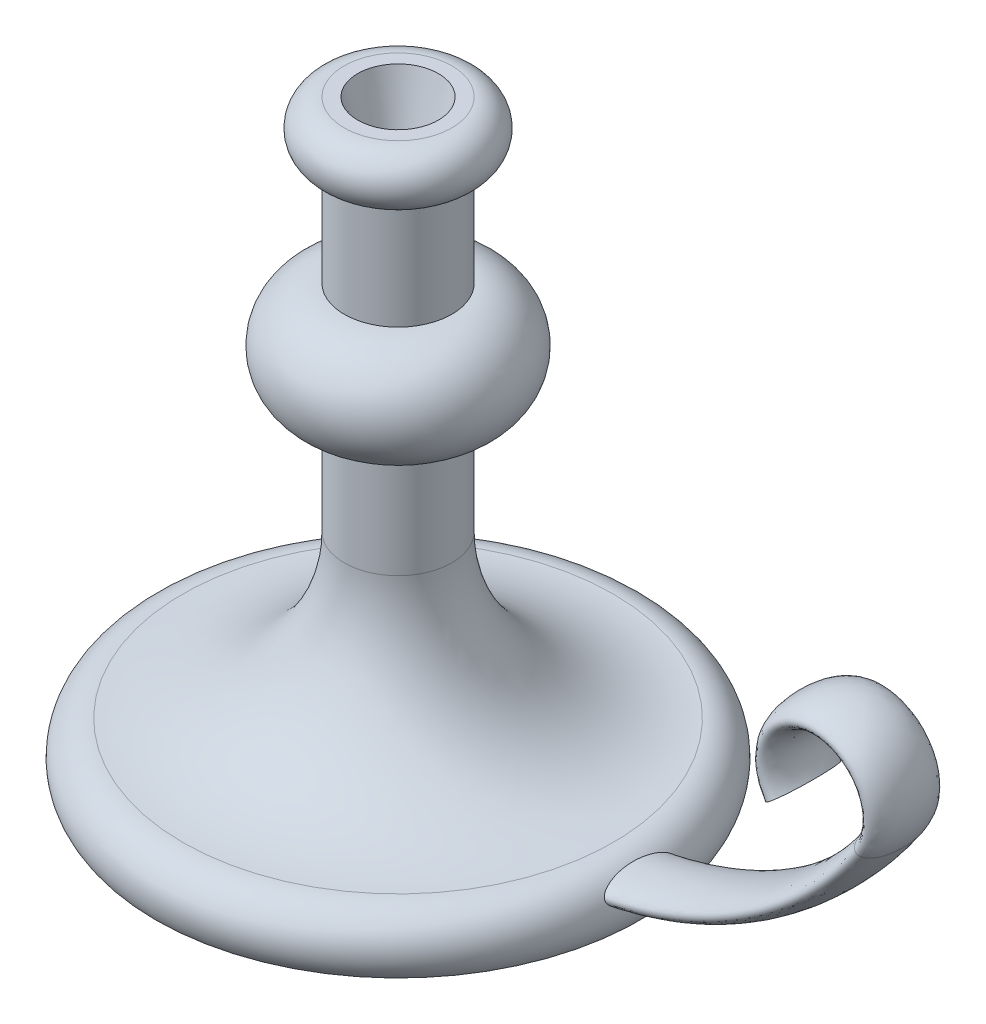
ISO-10303-21;
HEADER;
FILE_DESCRIPTION(('STEP AP214'),'2;1');
FILE_NAME('part.step','',(''),(''),'','','');
FILE_SCHEMA(('AUTOMOTIVE_DESIGN { 1 0 10303 214 1 1 1 1 }'));
ENDSEC;
DATA;
#1=APPLICATION_CONTEXT('core data for automotive mechanical design processes');
#2=APPLICATION_PROTOCOL_DEFINITION('international standard','automotive_design',2000,#1);
#3=PRODUCT_CONTEXT('',#1,'mechanical');
#4=PRODUCT('Part','Part','',(#3));
#5=PRODUCT_RELATED_PRODUCT_CATEGORY('part','',(#4));
#6=PRODUCT_DEFINITION_FORMATION('','',#4);
#7=PRODUCT_DEFINITION_CONTEXT('part definition',#1,'design');
#8=PRODUCT_DEFINITION('design','',#6,#7);
#9=PRODUCT_DEFINITION_SHAPE('','',#8);
#10=(LENGTH_UNIT() NAMED_UNIT(*) SI_UNIT(.MILLI.,.METRE.));
#11=(NAMED_UNIT(*) PLANE_ANGLE_UNIT() SI_UNIT($,.RADIAN.));
#12=(NAMED_UNIT(*) SI_UNIT($,.STERADIAN.) SOLID_ANGLE_UNIT());
#13=UNCERTAINTY_MEASURE_WITH_UNIT(LENGTH_MEASURE(1.E-05),#10,'distance_accuracy_value','');
#14=(GEOMETRIC_REPRESENTATION_CONTEXT(3) GLOBAL_UNCERTAINTY_ASSIGNED_CONTEXT((#13)) GLOBAL_UNIT_ASSIGNED_CONTEXT((#10,
#11,#12)) REPRESENTATION_CONTEXT('',''));
#15=CARTESIAN_POINT('',(0.,0.,0.));
#16=DIRECTION('',(0.,0.,1.));
#17=DIRECTION('',(1.,0.,0.));
#18=AXIS2_PLACEMENT_3D('',#15,#16,#17);
#19=CARTESIAN_POINT('',(0.,0.,0.));
#20=DIRECTION('',(0.,-1.,0.));
#21=DIRECTION('',(0.,0.,-1.));
#22=AXIS2_PLACEMENT_3D('',#19,#20,#21);
#23=PLANE('',#22);
#24=CARTESIAN_POINT('',(0.,0.,0.));
#25=DIRECTION('',(0.,-1.,0.));
#26=DIRECTION('',(0.,0.,-1.));
#27=AXIS2_PLACEMENT_3D('',#24,#25,#26);
#28=CIRCLE('',#27,90.);
#29=CARTESIAN_POINT('',(0.,0.,-90.));
#30=VERTEX_POINT('',#29);
#31=EDGE_CURVE('E74',#30,#30,#28,.T.);
#32=ORIENTED_EDGE('',*,*,#31,.T.);
#33=EDGE_LOOP('',(#32));
#34=FACE_BOUND('',#33,.T.);
#35=ADVANCED_FACE('F41',(#34),#23,.T.);
#36=CARTESIAN_POINT('',(0.,220.,0.));
#37=DIRECTION('',(0.,1.,0.));
#38=DIRECTION('',(0.,0.,1.));
#39=AXIS2_PLACEMENT_3D('',#36,#37,#38);
#40=PLANE('',#39);
#41=CARTESIAN_POINT('',(0.,220.,0.));
#42=DIRECTION('',(0.,1.,0.));
#43=DIRECTION('',(0.,0.,1.));
#44=AXIS2_PLACEMENT_3D('',#41,#42,#43);
#45=CIRCLE('',#44,15.);
#46=CARTESIAN_POINT('',(0.,220.,15.));
#47=VERTEX_POINT('',#46);
#48=EDGE_CURVE('E86',#47,#47,#45,.T.);
#49=ORIENTED_EDGE('',*,*,#48,.F.);
#50=EDGE_LOOP('',(#49));
#51=FACE_BOUND('',#50,.T.);
#52=CARTESIAN_POINT('',(0.,220.,0.));
#53=DIRECTION('',(0.,-1.,0.));
#54=DIRECTION('',(0.,0.,-1.));
#55=AXIS2_PLACEMENT_3D('',#52,#53,#54);
#56=CIRCLE('',#55,20.);
#57=CARTESIAN_POINT('',(0.,220.,-20.));
#58=VERTEX_POINT('',#57);
#59=EDGE_CURVE('E52',#58,#58,#56,.T.);
#60=ORIENTED_EDGE('',*,*,#59,.F.);
#61=EDGE_LOOP('',(#60));
#62=FACE_BOUND('',#61,.T.);
#63=ADVANCED_FACE('F92',(#51,#62),#40,.T.);
#64=CARTESIAN_POINT('',(0.,210.,0.));
#65=DIRECTION('',(0.,-1.,0.));
#66=DIRECTION('',(0.,0.,-1.));
#67=AXIS2_PLACEMENT_3D('',#64,#65,#66);
#68=TOROIDAL_SURFACE('',#67,20.,10.);
#69=ORIENTED_EDGE('',*,*,#59,.T.);
#70=EDGE_LOOP('',(#69));
#71=FACE_BOUND('',#70,.T.);
#72=CARTESIAN_POINT('',(0.,200.,0.));
#73=DIRECTION('',(0.,-1.,0.));
#74=DIRECTION('',(0.,0.,-1.));
#75=AXIS2_PLACEMENT_3D('',#72,#73,#74);
#76=CIRCLE('',#75,20.);
#77=CARTESIAN_POINT('',(0.,200.,-20.));
#78=VERTEX_POINT('',#77);
#79=EDGE_CURVE('E56',#78,#78,#76,.T.);
#80=ORIENTED_EDGE('',*,*,#79,.F.);
#81=EDGE_LOOP('',(#80));
#82=FACE_BOUND('',#81,.T.);
#83=ADVANCED_FACE('F95',(#71,#82),#68,.T.);
#84=CARTESIAN_POINT('',(0.,0.,0.));
#85=DIRECTION('',(0.,-1.,0.));
#86=DIRECTION('',(0.,0.,-1.));
#87=AXIS2_PLACEMENT_3D('',#84,#85,#86);
#88=CYLINDRICAL_SURFACE('',#87,20.);
#89=ORIENTED_EDGE('',*,*,#79,.T.);
#90=EDGE_LOOP('',(#89));
#91=FACE_BOUND('',#90,.T.);
#92=CARTESIAN_POINT('',(0.,160.,0.));
#93=DIRECTION('',(0.,-1.,0.));
#94=DIRECTION('',(0.,0.,-1.));
#95=AXIS2_PLACEMENT_3D('',#92,#93,#94);
#96=CIRCLE('',#95,20.);
#97=CARTESIAN_POINT('',(0.,160.,-20.));
#98=VERTEX_POINT('',#97);
#99=EDGE_CURVE('E60',#98,#98,#96,.T.);
#100=ORIENTED_EDGE('',*,*,#99,.F.);
#101=EDGE_LOOP('',(#100));
#102=FACE_BOUND('',#101,.T.);
#103=ADVANCED_FACE('F101',(#91,#102),#88,.T.);
#104=CARTESIAN_POINT('',(0.,140.,0.));
#105=DIRECTION('',(0.,-1.,0.));
#106=DIRECTION('',(0.,0.,-1.));
#107=AXIS2_PLACEMENT_3D('',#104,#105,#106);
#108=TOROIDAL_SURFACE('',#107,20.,20.);
#109=ORIENTED_EDGE('',*,*,#99,.T.);
#110=EDGE_LOOP('',(#109));
#111=FACE_BOUND('',#110,.T.);
#112=CARTESIAN_POINT('',(0.,120.,0.));
#113=DIRECTION('',(0.,-1.,0.));
#114=DIRECTION('',(0.,0.,-1.));
#115=AXIS2_PLACEMENT_3D('',#112,#113,#114);
#116=CIRCLE('',#115,20.);
#117=CARTESIAN_POINT('',(0.,120.,-20.));
#118=VERTEX_POINT('',#117);
#119=EDGE_CURVE('E65',#118,#118,#116,.T.);
#120=ORIENTED_EDGE('',*,*,#119,.F.);
#121=EDGE_LOOP('',(#120));
#122=FACE_BOUND('',#121,.T.);
#123=ADVANCED_FACE('F108',(#111,#122),#108,.T.);
#124=CARTESIAN_POINT('',(0.,0.,0.));
#125=DIRECTION('',(0.,-1.,0.));
#126=DIRECTION('',(0.,0.,-1.));
#127=AXIS2_PLACEMENT_3D('',#124,#125,#126);
#128=CYLINDRICAL_SURFACE('',#127,20.);
#129=ORIENTED_EDGE('',*,*,#119,.T.);
#130=EDGE_LOOP('',(#129));
#131=FACE_BOUND('',#130,.T.);
#132=CARTESIAN_POINT('',(0.,79.9999999999999,0.));
#133=DIRECTION('',(0.,-1.,0.));
#134=DIRECTION('',(0.,0.,-1.));
#135=AXIS2_PLACEMENT_3D('',#132,#133,#134);
#136=CIRCLE('',#135,20.);
#137=CARTESIAN_POINT('',(0.,79.9999999999999,-20.));
#138=VERTEX_POINT('',#137);
#139=EDGE_CURVE('E68',#138,#138,#136,.T.);
#140=ORIENTED_EDGE('',*,*,#139,.F.);
#141=EDGE_LOOP('',(#140));
#142=FACE_BOUND('',#141,.T.);
#143=ADVANCED_FACE('F112',(#131,#142),#128,.T.);
#144=CARTESIAN_POINT('',(0.,80.,0.));
#145=DIRECTION('',(0.,-1.,0.));
#146=DIRECTION('',(0.,0.,-1.));
#147=AXIS2_PLACEMENT_3D('',#144,#145,#146);
#148=TOROIDAL_SURFACE('',#147,80.,60.);
#149=ORIENTED_EDGE('',*,*,#139,.T.);
#150=EDGE_LOOP('',(#149));
#151=FACE_BOUND('',#150,.T.);
#152=CARTESIAN_POINT('',(0.,20.,0.));
#153=DIRECTION('',(0.,-1.,0.));
#154=DIRECTION('',(0.,0.,-1.));
#155=AXIS2_PLACEMENT_3D('',#152,#153,#154);
#156=CIRCLE('',#155,79.9999999999999);
#157=CARTESIAN_POINT('',(0.,20.,-79.9999999999999));
#158=VERTEX_POINT('',#157);
#159=EDGE_CURVE('E71',#158,#158,#156,.T.);
#160=ORIENTED_EDGE('',*,*,#159,.F.);
#161=EDGE_LOOP('',(#160));
#162=FACE_BOUND('',#161,.T.);
#163=ADVANCED_FACE('F116',(#151,#162),#148,.F.);
#164=CARTESIAN_POINT('',(0.,7.49999999999996,0.));
#165=DIRECTION('',(0.,-1.,0.));
#166=DIRECTION('',(0.,0.,-1.));
#167=AXIS2_PLACEMENT_3D('',#164,#165,#166);
#168=TOROIDAL_SURFACE('',#167,80.,12.5);
#169=CARTESIAN_POINT('',(90.2086800058325,13.0733664296864,-13.3333333333333));
#170=CARTESIAN_POINT('',(90.180788341327,13.1287581038346,-13.3333335065266));
#171=CARTESIAN_POINT('',(90.152819751234,13.1841126871976,-13.3304579714573));
#172=CARTESIAN_POINT('',(90.096953081087,13.2942710618353,-13.3190582345396));
#173=CARTESIAN_POINT('',(90.0690550051756,13.3490748212875,-13.3105337082183));
#174=CARTESIAN_POINT('',(90.0135163223238,13.4577415940159,-13.2880887667924));
#175=CARTESIAN_POINT('',(89.9858759076496,13.5116039275173,-13.2741646083921));
#176=CARTESIAN_POINT('',(89.9310311482349,13.6180274414278,-13.241296367624));
#177=CARTESIAN_POINT('',(89.9038270434493,13.6705879139625,-13.2223496170623));
#178=CARTESIAN_POINT('',(89.8428213050026,13.7879333165246,-13.1742292294118));
#179=CARTESIAN_POINT('',(89.8091933699416,13.852243414543,-13.1436757704697));
#180=CARTESIAN_POINT('',(89.7430189103146,13.9780544382001,-13.076200643521));
#181=CARTESIAN_POINT('',(89.7104732397881,14.039553159014,-13.039274082213));
#182=CARTESIAN_POINT('',(89.6465154003189,14.1596758428068,-12.9599437213261));
#183=CARTESIAN_POINT('',(89.6151050735415,14.218295184661,-12.9175314901343));
#184=CARTESIAN_POINT('',(89.5534977703328,14.3325530571061,-12.8281300002245));
#185=CARTESIAN_POINT('',(89.5233005256941,14.3881922475132,-12.7811417611979));
#186=CARTESIAN_POINT('',(89.4439005056219,14.5335594653448,-12.6499588157859));
#187=CARTESIAN_POINT('',(89.3957661862561,14.6206856668047,-12.5622261968992));
#188=CARTESIAN_POINT('',(89.3025596119839,14.7875884687574,-12.3785249052795));
#189=CARTESIAN_POINT('',(89.2574896484861,14.8673595849294,-12.2825501881792));
#190=CARTESIAN_POINT('',(89.1700362837097,15.020470456462,-12.0841212574802));
#191=CARTESIAN_POINT('',(89.1276587788778,15.0937962226433,-11.9816537421325));
#192=CARTESIAN_POINT('',(89.0454135891316,15.2345544871548,-11.7718544500061));
#193=CARTESIAN_POINT('',(89.0055453677156,15.3019882464409,-11.6645237215133));
#194=CARTESIAN_POINT('',(88.9253874422836,15.4360941875148,-11.4384873950312));
#195=CARTESIAN_POINT('',(88.8852568656295,15.5023959459515,-11.3195068563186));
#196=CARTESIAN_POINT('',(88.8072827154018,15.6297370336076,-11.0780136964315));
#197=CARTESIAN_POINT('',(88.7694396791958,15.6907751277616,-10.9555002552472));
#198=CARTESIAN_POINT('',(88.6958036195511,15.8081904873548,-10.707535571938));
#199=CARTESIAN_POINT('',(88.6600122903065,15.8645639175138,-10.5820820190897));
#200=CARTESIAN_POINT('',(88.5903362154428,15.9730719595632,-10.3288274798586));
#201=CARTESIAN_POINT('',(88.5564516996087,16.0252060609192,-10.2010262130104));
#202=CARTESIAN_POINT('',(88.4573163032156,16.1760504112737,-9.81422350770335));
#203=CARTESIAN_POINT('',(88.3947172452799,16.2689908808603,-9.55228013387044));
#204=CARTESIAN_POINT('',(88.2758015970914,16.4419450221625,-9.02295772190436));
#205=CARTESIAN_POINT('',(88.2194825782747,16.5219636962892,-8.75558083259615));
#206=CARTESIAN_POINT('',(88.12525302961,16.6532647526946,-8.28050995752687));
#207=CARTESIAN_POINT('',(88.08614275208,16.7068634208172,-8.07368683649478));
#208=CARTESIAN_POINT('',(88.0111201099692,16.8082161892091,-7.65803366104923));
#209=CARTESIAN_POINT('',(87.9752079433209,16.8559699278013,-7.44920348330301));
#210=CARTESIAN_POINT('',(87.8720580390742,16.9913110848532,-6.81988789896631));
#211=CARTESIAN_POINT('',(87.8094696938684,17.0708921216136,-6.39689693205009));
#212=CARTESIAN_POINT('',(87.6963296904708,17.2116946332599,-5.54616474321149));
#213=CARTESIAN_POINT('',(87.645783147211,17.2729083091947,-5.11842158317931));
#214=CARTESIAN_POINT('',(87.5566607082591,17.3790242853826,-4.25872185122846));
#215=CARTESIAN_POINT('',(87.5181114641493,17.4238903070895,-3.82675806642227));
#216=CARTESIAN_POINT('',(87.4533024808533,17.4984291226988,-2.96085052023624));
#217=CARTESIAN_POINT('',(87.4270362081082,17.528109994679,-2.52690793574537));
#218=CARTESIAN_POINT('',(87.3869398918786,17.5731300549506,-1.6577899237346));
#219=CARTESIAN_POINT('',(87.3731077118968,17.5884717071072,-1.22261472090603));
#220=CARTESIAN_POINT('',(87.357160148827,17.6061532462903,-0.30407167630149));
#221=CARTESIAN_POINT('',(87.356494192294,17.6068848395905,0.179353527193571));
#222=CARTESIAN_POINT('',(87.3706173067994,17.5912375300013,1.14583125496165));
#223=CARTESIAN_POINT('',(87.385410624598,17.5748539254595,1.62888364033024));
#224=CARTESIAN_POINT('',(87.4303180900927,17.5244179994886,2.59363157238418));
#225=CARTESIAN_POINT('',(87.4604406562886,17.4903559692369,3.07532622711445));
#226=CARTESIAN_POINT('',(87.5356427079468,17.403537268173,4.03421366266309));
#227=CARTESIAN_POINT('',(87.5806713768974,17.350844072014,4.51141614999079));
#228=CARTESIAN_POINT('',(87.6855054513775,17.2248458401586,5.4613133814671));
#229=CARTESIAN_POINT('',(87.7453040995963,17.1515502280197,5.93401008460004));
#230=CARTESIAN_POINT('',(87.8461384082646,17.0238995659159,6.63799284389236));
#231=CARTESIAN_POINT('',(87.8815894543343,16.9784199212847,6.87171733151569));
#232=CARTESIAN_POINT('',(87.956281259254,16.8810132452122,7.33720186133338));
#233=CARTESIAN_POINT('',(87.9955216567015,16.8290868284853,7.56896208857665));
#234=CARTESIAN_POINT('',(88.0692118195033,16.7298503236631,7.98137675928796));
#235=CARTESIAN_POINT('',(88.1029229272549,16.6838816203177,8.16248656481654));
#236=CARTESIAN_POINT('',(88.1728716497731,16.5871248757496,8.522923767582));
#237=CARTESIAN_POINT('',(88.2091091952013,16.5363369667768,8.70225121358171));
#238=CARTESIAN_POINT('',(88.2841577111113,16.4295765444934,9.0583718728281));
#239=CARTESIAN_POINT('',(88.3229628456748,16.3736156811338,9.23516979279913));
#240=CARTESIAN_POINT('',(88.4033904884436,16.25583204531,9.58614412963552));
#241=CARTESIAN_POINT('',(88.4450127219058,16.1940098442494,9.76032080012403));
#242=CARTESIAN_POINT('',(88.5312279284015,16.0639047155162,10.1050800899276));
#243=CARTESIAN_POINT('',(88.575814591266,15.9956353888185,10.2756693864966));
#244=CARTESIAN_POINT('',(88.668535131451,15.8513394172281,10.6134134863941));
#245=CARTESIAN_POINT('',(88.7166821725154,15.775283539623,10.780552288961));
#246=CARTESIAN_POINT('',(88.8176946744776,15.6130373496076,11.1124007497427));
#247=CARTESIAN_POINT('',(88.8706291600755,15.5266900202246,11.2770133964228));
#248=CARTESIAN_POINT('',(88.9811156384867,15.3433273907581,11.598885967195));
#249=CARTESIAN_POINT('',(89.0386718736252,15.2463022584975,11.7561389213438));
#250=CARTESIAN_POINT('',(89.1587599837859,15.0403117337069,12.0591769698947));
#251=CARTESIAN_POINT('',(89.2212597281084,14.931421949323,12.205025556361));
#252=CARTESIAN_POINT('',(89.3523701436711,14.6990161264433,12.4814034500695));
#253=CARTESIAN_POINT('',(89.4209660124921,14.5755352892695,12.6119681727889));
#254=CARTESIAN_POINT('',(89.5184729600696,14.3970352125889,12.7731999307196));
#255=CARTESIAN_POINT('',(89.5443726121328,14.3493605935515,12.8138836897012));
#256=CARTESIAN_POINT('',(89.5970521398833,14.2518450575757,12.891927463411));
#257=CARTESIAN_POINT('',(89.6238319727269,14.2020042460411,12.9292876395907));
#258=CARTESIAN_POINT('',(89.7055265237754,14.0491165217339,13.0356397148151));
#259=CARTESIAN_POINT('',(89.7618247931055,13.9426522260166,13.098951468648));
#260=CARTESIAN_POINT('',(89.8489072745659,13.7762379977576,13.1791112148032));
#261=CARTESIAN_POINT('',(89.8785757723234,13.7192537801046,13.2034721750676));
#262=CARTESIAN_POINT('',(89.9385554363041,13.6034798068172,13.246385144557));
#263=CARTESIAN_POINT('',(89.968866211596,13.5446911402362,13.264940584773));
#264=CARTESIAN_POINT('',(90.0299035404707,13.4257562006313,13.2956552790204));
#265=CARTESIAN_POINT('',(90.0606295820748,13.3656115473723,13.307821782236));
#266=CARTESIAN_POINT('',(90.1222717119844,13.2444319745412,13.325356425505));
#267=CARTESIAN_POINT('',(90.1531877745841,13.1833971739168,13.3307254656149));
#268=CARTESIAN_POINT('',(90.2118325877534,13.0671683646198,13.3342670387288));
#269=CARTESIAN_POINT('',(90.2395716903376,13.011998963916,13.3331039303349));
#270=CARTESIAN_POINT('',(90.2947427117053,12.901922750863,13.3251209069921));
#271=CARTESIAN_POINT('',(90.322174656418,12.8470159165766,13.3183014732346));
#272=CARTESIAN_POINT('',(90.3765421673408,12.7378872409271,13.2991892727063));
#273=CARTESIAN_POINT('',(90.4034774973687,12.6836657291607,13.2868939682318));
#274=CARTESIAN_POINT('',(90.4566823296764,12.5762949683426,13.2571510736377));
#275=CARTESIAN_POINT('',(90.4829514710162,12.52314630361,13.2397007526703));
#276=CARTESIAN_POINT('',(90.5400172358396,12.407436495414,13.1959820616535));
#277=CARTESIAN_POINT('',(90.570631935662,12.3451914563731,13.1686377399029));
#278=CARTESIAN_POINT('',(90.6305661968975,12.2230657323038,13.1078771413485));
#279=CARTESIAN_POINT('',(90.6598848219995,12.1631867597812,13.0744565612471));
#280=CARTESIAN_POINT('',(90.7458515678389,11.9872941475931,12.9662580267986));
#281=CARTESIAN_POINT('',(90.8004717184071,11.8751037454173,12.883574908411));
#282=CARTESIAN_POINT('',(90.894737680045,11.6810271255817,12.7197944365554));
#283=CARTESIAN_POINT('',(90.9352864848516,11.5973698209156,12.6412217879515));
#284=CARTESIAN_POINT('',(91.0131947397502,11.4364190041964,12.4762652339227));
#285=CARTESIAN_POINT('',(91.0505519912252,11.3591298803785,12.3898760268046));
#286=CARTESIAN_POINT('',(91.1224339798415,11.2102795621795,12.2109418532699));
#287=CARTESIAN_POINT('',(91.1569531741383,11.1387295829338,12.1183854514432));
#288=CARTESIAN_POINT('',(91.2234183257203,11.000888064833,11.9285212309726));
#289=CARTESIAN_POINT('',(91.2553632524378,10.9345986321154,11.8312115342149));
#290=CARTESIAN_POINT('',(91.3181217523447,10.804330816201,11.6290646061276));
#291=CARTESIAN_POINT('',(91.3488460219604,10.7405363540641,11.5240818371369));
#292=CARTESIAN_POINT('',(91.4080790356247,10.6175379811277,11.310891008472));
#293=CARTESIAN_POINT('',(91.4365880270765,10.5583335577127,11.2026833108318));
#294=CARTESIAN_POINT('',(91.5192105103973,10.3867683278255,10.8739147619694));
#295=CARTESIAN_POINT('',(91.5703663951527,10.280565895028,10.6493844496495));
#296=CARTESIAN_POINT('',(91.6662799753602,10.0815637584385,10.1928065639043));
#297=CARTESIAN_POINT('',(91.7110268358239,9.98878674877176,9.96074705528049));
#298=CARTESIAN_POINT('',(91.7950306198109,9.81475672780478,9.49151061577691));
#299=CARTESIAN_POINT('',(91.834289714001,9.73349915984836,9.25433575135275));
#300=CARTESIAN_POINT('',(91.9004981324637,9.59658752858072,8.82523867566787));
#301=CARTESIAN_POINT('',(91.9283196220422,9.53910259867727,8.63402713848537));
#302=CARTESIAN_POINT('',(91.9812588420091,9.42980176360957,8.24961301416731));
#303=CARTESIAN_POINT('',(92.0063763821213,9.37798625739696,8.05641028795919));
#304=CARTESIAN_POINT('',(92.0780703808655,9.23019775390434,7.47403626983678));
#305=CARTESIAN_POINT('',(92.120939177651,9.14198412609794,7.08242375855113));
#306=CARTESIAN_POINT('',(92.1981542330092,8.98330015530215,6.29467882955877));
#307=CARTESIAN_POINT('',(92.2324964730307,8.91283817840553,5.89854437231186));
#308=CARTESIAN_POINT('',(92.2936681044489,8.78746567734575,5.10143458119271));
#309=CARTESIAN_POINT('',(92.3204631216469,8.73262629453559,4.70044550625445));
#310=CARTESIAN_POINT('',(92.3669413962499,8.637583169637,3.89659145303966));
#311=CARTESIAN_POINT('',(92.3866289135178,8.59737066085739,3.49372774547806));
#312=CARTESIAN_POINT('',(92.4193223472057,8.5306316717591,2.68669103262861));
#313=CARTESIAN_POINT('',(92.4323295986448,8.50410245689495,2.28251830520173));
#314=CARTESIAN_POINT('',(92.4528415547191,8.4622791441192,1.43545219316509));
#315=CARTESIAN_POINT('',(92.459716302015,8.44827104003704,0.992479982679875));
#316=CARTESIAN_POINT('',(92.4659408875234,8.4355873310318,0.106134080093214));
#317=CARTESIAN_POINT('',(92.4652884500804,8.43691636290721,-0.337239692899369));
#318=CARTESIAN_POINT('',(92.4564355793488,8.45495679517213,-1.22389158655684));
#319=CARTESIAN_POINT('',(92.448230233644,8.47167820677538,-1.66716945714365));
#320=CARTESIAN_POINT('',(92.424067132336,8.5209548368371,-2.5531194757809));
#321=CARTESIAN_POINT('',(92.4081010559628,8.55352704998526,-2.99579046113968));
#322=CARTESIAN_POINT('',(92.3681631531045,8.6350905342814,-3.87639123251521));
#323=CARTESIAN_POINT('',(92.3442435901861,8.68397462483198,-4.31433318749452));
#324=CARTESIAN_POINT('',(92.2877731358682,8.7995418354144,-5.1871618457957));
#325=CARTESIAN_POINT('',(92.2552253337909,8.86621858488051,-5.62204958557745));
#326=CARTESIAN_POINT('',(92.180611682228,9.01932594677996,-6.48696495122176));
#327=CARTESIAN_POINT('',(92.1385593329778,9.10572854241302,-6.9169985709457));
#328=CARTESIAN_POINT('',(92.0672741399216,9.25247107350055,-7.5569019919614));
#329=CARTESIAN_POINT('',(92.0421614752106,9.30420692128283,-7.76922432421051));
#330=CARTESIAN_POINT('',(91.9889402575543,9.41395111246939,-8.19185524081158));
#331=CARTESIAN_POINT('',(91.9608320343787,9.47195876544465,-8.40216404405304));
#332=CARTESIAN_POINT('',(91.9085527213417,9.57994743368127,-8.76937323315616));
#333=CARTESIAN_POINT('',(91.8850890535126,9.62844453843324,-8.9268113280052));
#334=CARTESIAN_POINT('',(91.8360958702094,9.72977545602181,-9.2399747432707));
#335=CARTESIAN_POINT('',(91.8105662791026,9.78260942763057,-9.39570000074351));
#336=CARTESIAN_POINT('',(91.7572969781158,9.8929189992222,-9.70472229737918));
#337=CARTESIAN_POINT('',(91.7295623040069,9.95038402708413,-9.85802396231681));
#338=CARTESIAN_POINT('',(91.6715871862169,10.0705703084383,-10.1620619653613));
#339=CARTESIAN_POINT('',(91.6413470334746,10.1332909516525,-10.3127985988787));
#340=CARTESIAN_POINT('',(91.5781140944473,10.2644958400291,-10.6107888225506));
#341=CARTESIAN_POINT('',(91.54512706045,10.3329680432606,-10.7580489018422));
#342=CARTESIAN_POINT('',(91.4758292296258,10.4768451592312,-11.0491123117612));
#343=CARTESIAN_POINT('',(91.439505986958,10.5522760365642,-11.192899943918));
#344=CARTESIAN_POINT('',(91.3624363723811,10.7123175724726,-11.4778781222357));
#345=CARTESIAN_POINT('',(91.3216192800916,10.79707498813,-11.6189679620731));
#346=CARTESIAN_POINT('',(91.2354579747566,10.9759112173033,-11.893930146009));
#347=CARTESIAN_POINT('',(91.1901098858331,11.0699980107681,-12.0277961573803));
#348=CARTESIAN_POINT('',(91.0943892249745,11.2683886380523,-12.2846479434741));
#349=CARTESIAN_POINT('',(91.0440460185181,11.372632700582,-12.4076901207075));
#350=CARTESIAN_POINT('',(90.9373229657141,11.5931997836471,-12.6392927816353));
#351=CARTESIAN_POINT('',(90.8809568001749,11.709495412319,-12.747884878083));
#352=CARTESIAN_POINT('',(90.7732449531029,11.9310214784737,-12.9249176486317));
#353=CARTESIAN_POINT('',(90.7231262484143,12.033860810337,-12.9970491634382));
#354=CARTESIAN_POINT('',(90.618442888204,12.2478820148396,-13.1235383269763));
#355=CARTESIAN_POINT('',(90.5638852022029,12.359050788741,-13.1779231912542));
#356=CARTESIAN_POINT('',(90.4596905079436,12.570302613292,-13.2573248200095));
#357=CARTESIAN_POINT('',(90.4106136248049,12.6694095652317,-13.2855995338625));
#358=CARTESIAN_POINT('',(90.3356717709416,12.8199545895441,-13.3141190169012));
#359=CARTESIAN_POINT('',(90.3104632207955,12.870463974378,-13.3213101427754));
#360=CARTESIAN_POINT('',(90.2597512695538,12.9717815010944,-13.33091650984));
#361=CARTESIAN_POINT('',(90.2342479586249,13.0225895493953,-13.3333331745691));
#362=CARTESIAN_POINT('',(90.2086800058325,13.0733664296864,-13.3333333333333));
#363=B_SPLINE_CURVE_WITH_KNOTS('',3,(#169,#170,#171,#172,#173,#174,#175,#176,#177,#178,#179,
#180,#181,#182,#183,#184,#185,#186,#187,#188,#189,#190,#191,#192,#193,#194,#195,#196,#197,#198,
#199,#200,#201,#202,#203,#204,#205,#206,#207,#208,#209,#210,#211,#212,#213,#214,#215,#216,#217,
#218,#219,#220,#221,#222,#223,#224,#225,#226,#227,#228,#229,#230,#231,#232,#233,#234,#235,#236,
#237,#238,#239,#240,#241,#242,#243,#244,#245,#246,#247,#248,#249,#250,#251,#252,#253,#254,#255,
#256,#257,#258,#259,#260,#261,#262,#263,#264,#265,#266,#267,#268,#269,#270,#271,#272,#273,#274,
#275,#276,#277,#278,#279,#280,#281,#282,#283,#284,#285,#286,#287,#288,#289,#290,#291,#292,#293,
#294,#295,#296,#297,#298,#299,#300,#301,#302,#303,#304,#305,#306,#307,#308,#309,#310,#311,#312,
#313,#314,#315,#316,#317,#318,#319,#320,#321,#322,#323,#324,#325,#326,#327,#328,#329,#330,#331,
#332,#333,#334,#335,#336,#337,#338,#339,#340,#341,#342,#343,#344,#345,#346,#347,#348,#349,#350,
#351,#352,#353,#354,#355,#356,#357,#358,#359,#360,#361,#362),.UNSPECIFIED.,.T.,.F.,(4,2,2,2,2,2,
2,2,2,2,2,2,2,2,2,2,2,2,2,2,2,2,2,2,2,2,2,2,2,2,2,2,2,2,2,2,2,2,2,2,2,2,2,2,2,2,2,2,2,2,2,2,2,2,
2,2,2,2,2,2,2,2,2,2,2,2,2,2,2,2,2,2,2,2,2,2,2,2,2,2,2,2,2,2,2,2,2,2,2,2,2,2,2,2,2,2,4),(0.,
0.185990097827683,0.37199087968791,0.558120837798939,0.744349874140249,0.980205255875181,
1.21624254085914,1.45264703094526,1.68899896201939,2.08638043676208,2.4840558625135,
2.88257413523765,3.2810069105846,3.70680552152543,4.13270377147952,4.55894878511026,
4.98524505484122,5.83939765079738,6.69321878204485,7.34471715759756,7.99625582671903,
9.30034204449862,10.6049812082912,11.9124982297635,13.2193189633705,14.525915108591,
15.9756354531349,17.4257541497128,18.8766700816674,20.3226897662739,21.7680491138942,
22.4901498566903,23.2121817983428,23.7817142277784,24.3512310324875,24.9194951100068,
25.4877038460777,26.0547395736905,26.6239881179037,27.2034246483874,27.7833992633066,
28.359873072287,28.9349834755544,29.13831833455,29.3416433106329,29.7480650863485,
29.9539732530485,30.1597594996838,30.3653117444136,30.5708367689887,30.7558630444344,
30.940873581051,31.1259699471659,31.311164543651,31.5345041578328,31.7580025650236,
32.2052763322989,32.5699859707299,32.9349448600899,33.3006003865779,33.6664015777296,
34.0461220820256,34.4258001178636,35.1857971931712,35.947064313208,36.7080294594265,
37.3127016880495,37.9174164395197,39.1278749672096,40.3389029035554,41.5553604839585,
42.7710877682712,43.9865720006614,45.3159729859899,46.6457758928995,47.9764443160523,
49.3085425904325,50.6320549548283,51.9550940770958,53.2762656380563,53.9360907650723,
54.5958433293322,55.0949790163004,55.5941329847202,56.0921780821305,56.5901654268668,
57.0871349611022,57.5860402292498,58.0943908859984,58.603180177744,59.1091380722111,
59.6139702059733,60.0185178904534,60.4224422289956,60.7633532024656,60.9338989412652,
61.1043938229949),.UNSPECIFIED.);
#364=CARTESIAN_POINT('',(90.2086800058325,13.0733664296864,-13.3333333333333));
#365=VERTEX_POINT('',#364);
#366=EDGE_CURVE('E10',#365,#365,#363,.T.);
#367=ORIENTED_EDGE('',*,*,#366,.F.);
#368=EDGE_LOOP('',(#367));
#369=FACE_BOUND('',#368,.T.);
#370=ORIENTED_EDGE('',*,*,#159,.T.);
#371=EDGE_LOOP('',(#370));
#372=FACE_BOUND('',#371,.T.);
#373=ORIENTED_EDGE('',*,*,#31,.F.);
#374=EDGE_LOOP('',(#373));
#375=FACE_BOUND('',#374,.T.);
#376=ADVANCED_FACE('F119',(#369,#372,#375),#168,.T.);
#377=CARTESIAN_POINT('',(150.634185358261,75.,0.));
#378=DIRECTION('',(0.566666666666667,-0.823947139620552,0.));
#379=DIRECTION('',(0.,0.,-1.));
#380=AXIS2_PLACEMENT_3D('',#377,#378,#379);
#381=PLANE('',#380);
#382=CARTESIAN_POINT('',(150.634185358261,75.,0.));
#383=DIRECTION('',(0.566666666666667,-0.823947139620552,0.));
#384=DIRECTION('',(0.,0.,-1.));
#385=AXIS2_PLACEMENT_3D('',#382,#383,#384);
#386=ELLIPSE('',#385,13.3333333333333,5.);
#387=CARTESIAN_POINT('',(150.634185358261,75.,-13.3333333333333));
#388=VERTEX_POINT('',#387);
#389=EDGE_CURVE('E77',#388,#388,#386,.T.);
#390=ORIENTED_EDGE('',*,*,#389,.T.);
#391=EDGE_LOOP('',(#390));
#392=FACE_BOUND('',#391,.T.);
#393=ADVANCED_FACE('F124',(#392),#381,.T.);
#394=CARTESIAN_POINT('',(60.,10.,-13.3333333333333));
#395=CARTESIAN_POINT('',(110.410191303973,10.,-13.3333333333333));
#396=CARTESIAN_POINT('',(155.026295870831,33.4646670673665,-13.3333333333333));
#397=CARTESIAN_POINT('',(183.592070943083,75.,-13.3333333333333));
#398=CARTESIAN_POINT('',(60.,20.,-13.3333333333333));
#399=CARTESIAN_POINT('',(107.049511883708,20.,-13.3333333333333));
#400=CARTESIAN_POINT('',(148.691209479443,41.900355929542,-13.3333333333333));
#401=CARTESIAN_POINT('',(175.352599546877,80.6666666666666,-13.3333333333333));
#402=CARTESIAN_POINT('',(60.,20.,13.3333333333333));
#403=CARTESIAN_POINT('',(107.049511883708,20.,13.3333333333333));
#404=CARTESIAN_POINT('',(148.691209479443,41.900355929542,13.3333333333333));
#405=CARTESIAN_POINT('',(175.352599546877,80.6666666666666,13.3333333333333));
#406=CARTESIAN_POINT('',(60.,10.,13.3333333333333));
#407=CARTESIAN_POINT('',(110.410191303973,10.,13.3333333333333));
#408=CARTESIAN_POINT('',(155.026295870831,33.4646670673665,13.3333333333333));
#409=CARTESIAN_POINT('',(183.592070943083,75.,13.3333333333333));
#410=CARTESIAN_POINT('',(60.,0.,13.3333333333333));
#411=CARTESIAN_POINT('',(113.770870724238,0.,13.3333333333333));
#412=CARTESIAN_POINT('',(161.36138226222,25.0289782051909,13.3333333333333));
#413=CARTESIAN_POINT('',(191.831542339288,69.3333333333333,13.3333333333333));
#414=CARTESIAN_POINT('',(60.,0.,-13.3333333333333));
#415=CARTESIAN_POINT('',(113.770870724238,0.,-13.3333333333333));
#416=CARTESIAN_POINT('',(161.36138226222,25.0289782051909,-13.3333333333333));
#417=CARTESIAN_POINT('',(191.831542339288,69.3333333333333,-13.3333333333333));
#418=CARTESIAN_POINT('',(60.,10.,-13.3333333333333));
#419=CARTESIAN_POINT('',(110.410191303973,10.,-13.3333333333333));
#420=CARTESIAN_POINT('',(155.026295870831,33.4646670673665,-13.3333333333333));
#421=CARTESIAN_POINT('',(183.592070943083,75.,-13.3333333333333));
#422=(BOUNDED_SURFACE() B_SPLINE_SURFACE(3,3,((#394,#395,#396,#397),(#398,#399,#400,#401),(#402,
#403,#404,#405),(#406,#407,#408,#409),(#410,#411,#412,#413),(#414,#415,#416,#417),(#418,#419,
#420,#421)),.UNSPECIFIED.,.T.,.F.,.F.) B_SPLINE_SURFACE_WITH_KNOTS((4,3,4),(4,4),(0.,0.5,1.),
(0.,1.),.UNSPECIFIED.) GEOMETRIC_REPRESENTATION_ITEM() RATIONAL_B_SPLINE_SURFACE(((1.,
0.923374135437856,0.923374135437856,1.),(0.333333333333333,0.307791378479285,0.307791378479285,
0.333333333333333),(0.333333333333333,0.307791378479285,0.307791378479285,0.333333333333333),
(1.,0.923374135437856,0.923374135437856,1.),(0.333333333333333,0.307791378479285,
0.307791378479285,0.333333333333333),(0.333333333333333,0.307791378479285,0.307791378479285,
0.333333333333333),(1.,0.923374135437856,0.923374135437856,1.))) REPRESENTATION_ITEM('') SURFACE());
#423=CARTESIAN_POINT('',(183.592070943083,75.,0.));
#424=DIRECTION('',(0.566666666666667,0.823947139620552,0.));
#425=DIRECTION('',(0.,0.,-1.));
#426=AXIS2_PLACEMENT_3D('',#423,#424,#425);
#427=ELLIPSE('',#426,13.3333333333333,5.);
#428=CARTESIAN_POINT('',(183.592070943083,75.,-13.3333333333333));
#429=VERTEX_POINT('',#428);
#430=EDGE_CURVE('E80',#429,#429,#427,.T.);
#431=ORIENTED_EDGE('',*,*,#366,.T.);
#432=EDGE_LOOP('',(#431));
#433=FACE_BOUND('',#432,.T.);
#434=ORIENTED_EDGE('',*,*,#430,.F.);
#435=EDGE_LOOP('',(#434));
#436=FACE_BOUND('',#435,.T.);
#437=ADVANCED_FACE('F129',(#433,#436),#422,.T.);
#438=CARTESIAN_POINT('',(183.592070943083,75.,-13.3333333333333));
#439=CARTESIAN_POINT('',(193.981461744242,90.10642735238,-13.3333333333333));
#440=CARTESIAN_POINT('',(185.447347211541,106.333333333333,-13.3333333333333));
#441=CARTESIAN_POINT('',(167.113128150672,106.333333333333,-13.3333333333333));
#442=CARTESIAN_POINT('',(148.778909089802,106.333333333333,-13.3333333333333));
#443=CARTESIAN_POINT('',(140.244794557101,90.1064273523801,-13.3333333333333));
#444=CARTESIAN_POINT('',(150.634185358261,75.,-13.3333333333333));
#445=CARTESIAN_POINT('',(175.352599546877,80.6666666666667,-13.3333333333333));
#446=CARTESIAN_POINT('',(180.547294947457,88.2198803428567,-13.3333333333333));
#447=CARTESIAN_POINT('',(176.280237681107,96.3333333333333,-13.3333333333333));
#448=CARTESIAN_POINT('',(167.113128150672,96.3333333333333,-13.3333333333333));
#449=CARTESIAN_POINT('',(157.946018620237,96.3333333333334,-13.3333333333333));
#450=CARTESIAN_POINT('',(153.678961353887,88.2198803428568,-13.3333333333333));
#451=CARTESIAN_POINT('',(158.873656754466,80.6666666666667,-13.3333333333333));
#452=CARTESIAN_POINT('',(175.352599546877,80.6666666666667,13.3333333333333));
#453=CARTESIAN_POINT('',(180.547294947457,88.2198803428567,13.3333333333333));
#454=CARTESIAN_POINT('',(176.280237681107,96.3333333333333,13.3333333333333));
#455=CARTESIAN_POINT('',(167.113128150672,96.3333333333333,13.3333333333333));
#456=CARTESIAN_POINT('',(157.946018620237,96.3333333333334,13.3333333333333));
#457=CARTESIAN_POINT('',(153.678961353887,88.2198803428568,13.3333333333333));
#458=CARTESIAN_POINT('',(158.873656754466,80.6666666666667,13.3333333333333));
#459=CARTESIAN_POINT('',(183.592070943083,75.,13.3333333333333));
#460=CARTESIAN_POINT('',(193.981461744242,90.10642735238,13.3333333333333));
#461=CARTESIAN_POINT('',(185.447347211541,106.333333333333,13.3333333333333));
#462=CARTESIAN_POINT('',(167.113128150672,106.333333333333,13.3333333333333));
#463=CARTESIAN_POINT('',(148.778909089802,106.333333333333,13.3333333333333));
#464=CARTESIAN_POINT('',(140.244794557101,90.1064273523801,13.3333333333333));
#465=CARTESIAN_POINT('',(150.634185358261,75.,13.3333333333333));
#466=CARTESIAN_POINT('',(191.831542339288,69.3333333333333,13.3333333333333));
#467=CARTESIAN_POINT('',(207.415628541027,91.9929743619034,13.3333333333333));
#468=CARTESIAN_POINT('',(194.614456741976,116.333333333333,13.3333333333333));
#469=CARTESIAN_POINT('',(167.113128150672,116.333333333333,13.3333333333333));
#470=CARTESIAN_POINT('',(139.611799559367,116.333333333333,13.3333333333333));
#471=CARTESIAN_POINT('',(126.810627760316,91.9929743619035,13.3333333333333));
#472=CARTESIAN_POINT('',(142.394713962055,69.3333333333334,13.3333333333333));
#473=CARTESIAN_POINT('',(191.831542339288,69.3333333333333,-13.3333333333333));
#474=CARTESIAN_POINT('',(207.415628541027,91.9929743619034,-13.3333333333333));
#475=CARTESIAN_POINT('',(194.614456741976,116.333333333333,-13.3333333333333));
#476=CARTESIAN_POINT('',(167.113128150672,116.333333333333,-13.3333333333333));
#477=CARTESIAN_POINT('',(139.611799559367,116.333333333333,-13.3333333333333));
#478=CARTESIAN_POINT('',(126.810627760316,91.9929743619035,-13.3333333333333));
#479=CARTESIAN_POINT('',(142.394713962055,69.3333333333334,-13.3333333333333));
#480=CARTESIAN_POINT('',(183.592070943083,75.,-13.3333333333333));
#481=CARTESIAN_POINT('',(193.981461744242,90.10642735238,-13.3333333333333));
#482=CARTESIAN_POINT('',(185.447347211541,106.333333333333,-13.3333333333333));
#483=CARTESIAN_POINT('',(167.113128150672,106.333333333333,-13.3333333333333));
#484=CARTESIAN_POINT('',(148.778909089802,106.333333333333,-13.3333333333333));
#485=CARTESIAN_POINT('',(140.244794557101,90.1064273523801,-13.3333333333333));
#486=CARTESIAN_POINT('',(150.634185358261,75.,-13.3333333333333));
#487=(BOUNDED_SURFACE() B_SPLINE_SURFACE(3,3,((#438,#439,#440,#441,#442,#443,#444),(#445,#446,
#447,#448,#449,#450,#451),(#452,#453,#454,#455,#456,#457,#458),(#459,#460,#461,#462,#463,#464,
#465),(#466,#467,#468,#469,#470,#471,#472),(#473,#474,#475,#476,#477,#478,#479),(#480,#481,#482,
#483,#484,#485,#486)),.UNSPECIFIED.,.T.,.F.,.F.) B_SPLINE_SURFACE_WITH_KNOTS((4,3,4),(4,3,4),
(0.,0.5,1.),(0.,0.5,1.),
.UNSPECIFIED.) GEOMETRIC_REPRESENTATION_ITEM() RATIONAL_B_SPLINE_SURFACE(((1.,0.64364977875042,
0.64364977875042,1.,0.64364977875042,0.64364977875042,1.),(0.333333333333333,0.21454992625014,
0.21454992625014,0.333333333333333,0.21454992625014,0.21454992625014,0.333333333333333),
(0.333333333333333,0.21454992625014,0.21454992625014,0.333333333333333,0.21454992625014,
0.21454992625014,0.333333333333333),(1.,0.64364977875042,0.64364977875042,1.,0.64364977875042,
0.64364977875042,1.),(0.333333333333333,0.21454992625014,0.21454992625014,0.333333333333333,
0.21454992625014,0.21454992625014,0.333333333333333),(0.333333333333333,0.21454992625014,
0.21454992625014,0.333333333333333,0.21454992625014,0.21454992625014,0.333333333333333),(1.,
0.64364977875042,0.64364977875042,1.,0.64364977875042,0.64364977875042,1.))) REPRESENTATION_ITEM('') SURFACE());
#488=ORIENTED_EDGE('',*,*,#389,.F.);
#489=EDGE_LOOP('',(#488));
#490=FACE_BOUND('',#489,.T.);
#491=ORIENTED_EDGE('',*,*,#430,.T.);
#492=EDGE_LOOP('',(#491));
#493=FACE_BOUND('',#492,.T.);
#494=ADVANCED_FACE('F126',(#490,#493),#487,.T.);
#495=CARTESIAN_POINT('',(0.,220.,0.));
#496=DIRECTION('',(0.,1.,0.));
#497=DIRECTION('',(0.,0.,1.));
#498=AXIS2_PLACEMENT_3D('',#495,#496,#497);
#499=CONICAL_SURFACE('',#498,15.,0.26179938779915);
#500=CARTESIAN_POINT('',(0.,195.,0.));
#501=DIRECTION('',(0.,1.,0.));
#502=DIRECTION('',(0.,0.,1.));
#503=AXIS2_PLACEMENT_3D('',#500,#501,#502);
#504=CIRCLE('',#503,8.30127018922192);
#505=CARTESIAN_POINT('',(0.,195.,8.30127018922192));
#506=VERTEX_POINT('',#505);
#507=EDGE_CURVE('E83',#506,#506,#504,.T.);
#508=ORIENTED_EDGE('',*,*,#507,.F.);
#509=EDGE_LOOP('',(#508));
#510=FACE_BOUND('',#509,.T.);
#511=ORIENTED_EDGE('',*,*,#48,.T.);
#512=EDGE_LOOP('',(#511));
#513=FACE_BOUND('',#512,.T.);
#514=ADVANCED_FACE('F90',(#510,#513),#499,.F.);
#515=CARTESIAN_POINT('',(0.,195.,0.));
#516=DIRECTION('',(0.,1.,0.));
#517=DIRECTION('',(0.,0.,1.));
#518=AXIS2_PLACEMENT_3D('',#515,#516,#517);
#519=PLANE('',#518);
#520=ORIENTED_EDGE('',*,*,#507,.T.);
#521=EDGE_LOOP('',(#520));
#522=FACE_BOUND('',#521,.T.);
#523=ADVANCED_FACE('F150',(#522),#519,.T.);
#524=CLOSED_SHELL('',(#35,#63,#83,#103,#123,#143,#163,#376,#393,#437,#494,#514,#523));
#525=MANIFOLD_SOLID_BREP('B2',#524);
#526=ADVANCED_BREP_SHAPE_REPRESENTATION('',(#18,#525),#14);
#527=SHAPE_DEFINITION_REPRESENTATION(#9,#526);
ENDSEC;
END-ISO-10303-21;
